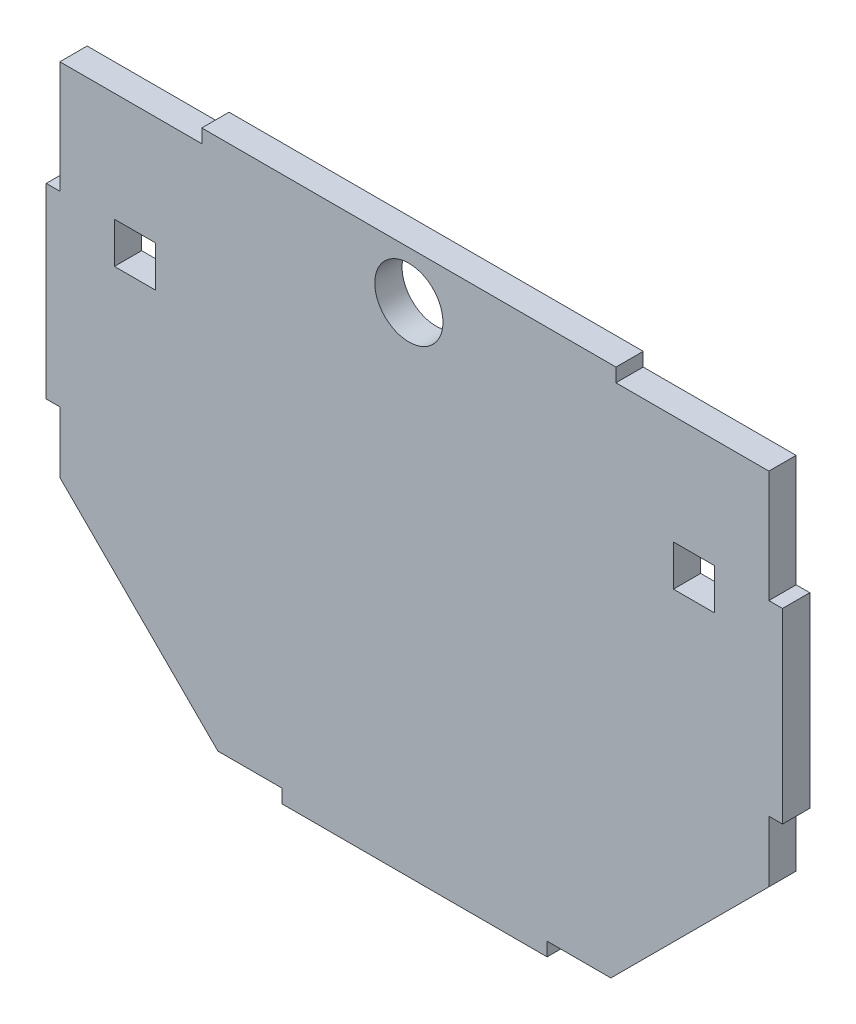
ISO-10303-21;
HEADER;
FILE_DESCRIPTION(('STEP AP214'),'2;1');
FILE_NAME('part.step','',(''),(''),'','','');
FILE_SCHEMA(('AUTOMOTIVE_DESIGN { 1 0 10303 214 1 1 1 1 }'));
ENDSEC;
DATA;
#1=APPLICATION_CONTEXT('core data for automotive mechanical design processes');
#2=APPLICATION_PROTOCOL_DEFINITION('international standard','automotive_design',2000,#1);
#3=PRODUCT_CONTEXT('',#1,'mechanical');
#4=PRODUCT('Part','Part','',(#3));
#5=PRODUCT_RELATED_PRODUCT_CATEGORY('part','',(#4));
#6=PRODUCT_DEFINITION_FORMATION('','',#4);
#7=PRODUCT_DEFINITION_CONTEXT('part definition',#1,'design');
#8=PRODUCT_DEFINITION('design','',#6,#7);
#9=PRODUCT_DEFINITION_SHAPE('','',#8);
#10=(LENGTH_UNIT() NAMED_UNIT(*) SI_UNIT(.MILLI.,.METRE.));
#11=(NAMED_UNIT(*) PLANE_ANGLE_UNIT() SI_UNIT($,.RADIAN.));
#12=(NAMED_UNIT(*) SI_UNIT($,.STERADIAN.) SOLID_ANGLE_UNIT());
#13=UNCERTAINTY_MEASURE_WITH_UNIT(LENGTH_MEASURE(1.E-05),#10,'distance_accuracy_value','');
#14=(GEOMETRIC_REPRESENTATION_CONTEXT(3) GLOBAL_UNCERTAINTY_ASSIGNED_CONTEXT((#13)) GLOBAL_UNIT_ASSIGNED_CONTEXT((#10,
#11,#12)) REPRESENTATION_CONTEXT('',''));
#15=CARTESIAN_POINT('',(0.,0.,0.));
#16=DIRECTION('',(0.,0.,1.));
#17=DIRECTION('',(1.,0.,0.));
#18=AXIS2_PLACEMENT_3D('',#15,#16,#17);
#19=CARTESIAN_POINT('',(498.299745886619,818.667305173515,12.7));
#20=DIRECTION('',(0.706896426643388,0.707317073170731,0.));
#21=DIRECTION('',(-0.707317073170731,0.706896426643388,0.));
#22=AXIS2_PLACEMENT_3D('',#19,#20,#21);
#23=PLANE('',#22);
#24=DIRECTION('',(0.707317073170731,-0.706896426643388,0.));
#25=VECTOR('',#24,1.);
#26=CARTESIAN_POINT('',(498.299745886619,818.667305173515,0.));
#27=LINE('',#26,#25);
#28=CARTESIAN_POINT('',(424.715446324431,892.207843625938,0.));
#29=VERTEX_POINT('',#28);
#30=CARTESIAN_POINT('',(498.299745886619,818.667305173515,0.));
#31=VERTEX_POINT('',#30);
#32=EDGE_CURVE('E268',#29,#31,#27,.T.);
#33=ORIENTED_EDGE('',*,*,#32,.T.);
#34=DIRECTION('',(0.,0.,-1.));
#35=VECTOR('',#34,1.);
#36=CARTESIAN_POINT('',(498.299745886619,818.667305173515,12.7));
#37=LINE('',#36,#35);
#38=CARTESIAN_POINT('',(498.299745886619,818.667305173515,12.7));
#39=VERTEX_POINT('',#38);
#40=EDGE_CURVE('E11',#39,#31,#37,.T.);
#41=ORIENTED_EDGE('',*,*,#40,.F.);
#42=DIRECTION('',(0.707317073170731,-0.706896426643388,0.));
#43=VECTOR('',#42,1.);
#44=CARTESIAN_POINT('',(498.299745886619,818.667305173515,12.7));
#45=LINE('',#44,#43);
#46=CARTESIAN_POINT('',(424.715446324431,892.207843625938,12.7));
#47=VERTEX_POINT('',#46);
#48=EDGE_CURVE('E307',#47,#39,#45,.T.);
#49=ORIENTED_EDGE('',*,*,#48,.F.);
#50=DIRECTION('',(0.,0.,-1.));
#51=VECTOR('',#50,1.);
#52=CARTESIAN_POINT('',(424.715446324431,892.207843625938,12.7));
#53=LINE('',#52,#51);
#54=EDGE_CURVE('E353',#47,#29,#53,.T.);
#55=ORIENTED_EDGE('',*,*,#54,.T.);
#56=EDGE_LOOP('',(#33,#41,#49,#55));
#57=FACE_BOUND('',#56,.T.);
#58=ADVANCED_FACE('F35',(#57),#23,.F.);
#59=CARTESIAN_POINT('',(528.064815274393,818.667305173515,12.7));
#60=DIRECTION('',(0.,1.,0.));
#61=DIRECTION('',(0.,0.,1.));
#62=AXIS2_PLACEMENT_3D('',#59,#60,#61);
#63=PLANE('',#62);
#64=DIRECTION('',(1.,0.,0.));
#65=VECTOR('',#64,1.);
#66=CARTESIAN_POINT('',(528.064815274393,818.667305173515,0.));
#67=LINE('',#66,#65);
#68=CARTESIAN_POINT('',(528.064815274393,818.667305173515,0.));
#69=VERTEX_POINT('',#68);
#70=EDGE_CURVE('E356',#31,#69,#67,.T.);
#71=ORIENTED_EDGE('',*,*,#70,.T.);
#72=DIRECTION('',(0.,0.,-1.));
#73=VECTOR('',#72,1.);
#74=CARTESIAN_POINT('',(528.064815274393,818.667305173515,12.7));
#75=LINE('',#74,#73);
#76=CARTESIAN_POINT('',(528.064815274393,818.667305173515,12.7));
#77=VERTEX_POINT('',#76);
#78=EDGE_CURVE('E42',#77,#69,#75,.T.);
#79=ORIENTED_EDGE('',*,*,#78,.F.);
#80=DIRECTION('',(1.,0.,0.));
#81=VECTOR('',#80,1.);
#82=CARTESIAN_POINT('',(528.064815274393,818.667305173515,12.7));
#83=LINE('',#82,#81);
#84=EDGE_CURVE('E310',#39,#77,#83,.T.);
#85=ORIENTED_EDGE('',*,*,#84,.F.);
#86=ORIENTED_EDGE('',*,*,#40,.T.);
#87=EDGE_LOOP('',(#71,#79,#85,#86));
#88=FACE_BOUND('',#87,.T.);
#89=ADVANCED_FACE('F482',(#88),#63,.F.);
#90=CARTESIAN_POINT('',(528.064815274393,812.317305173515,12.7));
#91=DIRECTION('',(1.,0.,0.));
#92=DIRECTION('',(0.,0.,-1.));
#93=AXIS2_PLACEMENT_3D('',#90,#91,#92);
#94=PLANE('',#93);
#95=DIRECTION('',(0.,-1.,0.));
#96=VECTOR('',#95,1.);
#97=CARTESIAN_POINT('',(528.064815274393,812.317305173515,0.));
#98=LINE('',#97,#96);
#99=CARTESIAN_POINT('',(528.064815274393,812.317305173515,0.));
#100=VERTEX_POINT('',#99);
#101=EDGE_CURVE('E358',#69,#100,#98,.T.);
#102=ORIENTED_EDGE('',*,*,#101,.T.);
#103=DIRECTION('',(0.,0.,-1.));
#104=VECTOR('',#103,1.);
#105=CARTESIAN_POINT('',(528.064815274393,812.317305173515,12.7));
#106=LINE('',#105,#104);
#107=CARTESIAN_POINT('',(528.064815274393,812.317305173515,12.7));
#108=VERTEX_POINT('',#107);
#109=EDGE_CURVE('E453',#108,#100,#106,.T.);
#110=ORIENTED_EDGE('',*,*,#109,.F.);
#111=DIRECTION('',(0.,-1.,0.));
#112=VECTOR('',#111,1.);
#113=CARTESIAN_POINT('',(528.064815274393,812.317305173515,12.7));
#114=LINE('',#113,#112);
#115=EDGE_CURVE('E313',#77,#108,#114,.T.);
#116=ORIENTED_EDGE('',*,*,#115,.F.);
#117=ORIENTED_EDGE('',*,*,#78,.T.);
#118=EDGE_LOOP('',(#102,#110,#116,#117));
#119=FACE_BOUND('',#118,.T.);
#120=ADVANCED_FACE('F460',(#119),#94,.F.);
#121=CARTESIAN_POINT('',(651.634447679094,812.317305173515,12.7));
#122=DIRECTION('',(0.,1.,0.));
#123=DIRECTION('',(0.,0.,1.));
#124=AXIS2_PLACEMENT_3D('',#121,#122,#123);
#125=PLANE('',#124);
#126=DIRECTION('',(1.,0.,0.));
#127=VECTOR('',#126,1.);
#128=CARTESIAN_POINT('',(651.634447679094,812.317305173515,0.));
#129=LINE('',#128,#127);
#130=CARTESIAN_POINT('',(651.634447679094,812.317305173515,0.));
#131=VERTEX_POINT('',#130);
#132=EDGE_CURVE('E360',#100,#131,#129,.T.);
#133=ORIENTED_EDGE('',*,*,#132,.T.);
#134=DIRECTION('',(0.,0.,-1.));
#135=VECTOR('',#134,1.);
#136=CARTESIAN_POINT('',(651.634447679094,812.317305173515,12.7));
#137=LINE('',#136,#135);
#138=CARTESIAN_POINT('',(651.634447679094,812.317305173515,12.7));
#139=VERTEX_POINT('',#138);
#140=EDGE_CURVE('E450',#139,#131,#137,.T.);
#141=ORIENTED_EDGE('',*,*,#140,.F.);
#142=DIRECTION('',(1.,0.,0.));
#143=VECTOR('',#142,1.);
#144=CARTESIAN_POINT('',(651.634447679094,812.317305173515,12.7));
#145=LINE('',#144,#143);
#146=EDGE_CURVE('E315',#108,#139,#145,.T.);
#147=ORIENTED_EDGE('',*,*,#146,.F.);
#148=ORIENTED_EDGE('',*,*,#109,.T.);
#149=EDGE_LOOP('',(#133,#141,#147,#148));
#150=FACE_BOUND('',#149,.T.);
#151=ADVANCED_FACE('F470',(#150),#125,.F.);
#152=CARTESIAN_POINT('',(651.634447679094,818.667305173515,12.7));
#153=DIRECTION('',(-1.,0.,0.));
#154=DIRECTION('',(0.,0.,1.));
#155=AXIS2_PLACEMENT_3D('',#152,#153,#154);
#156=PLANE('',#155);
#157=DIRECTION('',(0.,1.,0.));
#158=VECTOR('',#157,1.);
#159=CARTESIAN_POINT('',(651.634447679094,818.667305173515,0.));
#160=LINE('',#159,#158);
#161=CARTESIAN_POINT('',(651.634447679094,818.667305173515,0.));
#162=VERTEX_POINT('',#161);
#163=EDGE_CURVE('E362',#131,#162,#160,.T.);
#164=ORIENTED_EDGE('',*,*,#163,.T.);
#165=DIRECTION('',(0.,0.,-1.));
#166=VECTOR('',#165,1.);
#167=CARTESIAN_POINT('',(651.634447679094,818.667305173515,12.7));
#168=LINE('',#167,#166);
#169=CARTESIAN_POINT('',(651.634447679094,818.667305173515,12.7));
#170=VERTEX_POINT('',#169);
#171=EDGE_CURVE('E447',#170,#162,#168,.T.);
#172=ORIENTED_EDGE('',*,*,#171,.F.);
#173=DIRECTION('',(0.,1.,0.));
#174=VECTOR('',#173,1.);
#175=CARTESIAN_POINT('',(651.634447679094,818.667305173515,12.7));
#176=LINE('',#175,#174);
#177=EDGE_CURVE('E317',#139,#170,#176,.T.);
#178=ORIENTED_EDGE('',*,*,#177,.F.);
#179=ORIENTED_EDGE('',*,*,#140,.T.);
#180=EDGE_LOOP('',(#164,#172,#178,#179));
#181=FACE_BOUND('',#180,.T.);
#182=ADVANCED_FACE('F474',(#181),#156,.F.);
#183=CARTESIAN_POINT('',(681.331146762242,818.667305173515,12.7));
#184=DIRECTION('',(0.,1.,0.));
#185=DIRECTION('',(0.,0.,1.));
#186=AXIS2_PLACEMENT_3D('',#183,#184,#185);
#187=PLANE('',#186);
#188=DIRECTION('',(1.,0.,0.));
#189=VECTOR('',#188,1.);
#190=CARTESIAN_POINT('',(681.331146762242,818.667305173515,0.));
#191=LINE('',#190,#189);
#192=CARTESIAN_POINT('',(681.331146762242,818.667305173515,0.));
#193=VERTEX_POINT('',#192);
#194=EDGE_CURVE('E364',#162,#193,#191,.T.);
#195=ORIENTED_EDGE('',*,*,#194,.T.);
#196=DIRECTION('',(0.,0.,-1.));
#197=VECTOR('',#196,1.);
#198=CARTESIAN_POINT('',(681.331146762242,818.667305173515,12.7));
#199=LINE('',#198,#197);
#200=CARTESIAN_POINT('',(681.331146762242,818.667305173515,12.7));
#201=VERTEX_POINT('',#200);
#202=EDGE_CURVE('E444',#201,#193,#199,.T.);
#203=ORIENTED_EDGE('',*,*,#202,.F.);
#204=DIRECTION('',(1.,0.,0.));
#205=VECTOR('',#204,1.);
#206=CARTESIAN_POINT('',(681.331146762242,818.667305173515,12.7));
#207=LINE('',#206,#205);
#208=EDGE_CURVE('E319',#170,#201,#207,.T.);
#209=ORIENTED_EDGE('',*,*,#208,.F.);
#210=ORIENTED_EDGE('',*,*,#171,.T.);
#211=EDGE_LOOP('',(#195,#203,#209,#210));
#212=FACE_BOUND('',#211,.T.);
#213=ADVANCED_FACE('F565',(#212),#187,.F.);
#214=CARTESIAN_POINT('',(754.915446324431,892.207843625938,12.7));
#215=DIRECTION('',(-0.706896426643387,0.707317073170732,0.));
#216=DIRECTION('',(-0.707317073170732,-0.706896426643387,0.));
#217=AXIS2_PLACEMENT_3D('',#214,#215,#216);
#218=PLANE('',#217);
#219=DIRECTION('',(0.707317073170732,0.706896426643387,0.));
#220=VECTOR('',#219,1.);
#221=CARTESIAN_POINT('',(754.915446324431,892.207843625938,0.));
#222=LINE('',#221,#220);
#223=CARTESIAN_POINT('',(754.915446324431,892.207843625938,0.));
#224=VERTEX_POINT('',#223);
#225=EDGE_CURVE('E366',#193,#224,#222,.T.);
#226=ORIENTED_EDGE('',*,*,#225,.T.);
#227=DIRECTION('',(0.,0.,-1.));
#228=VECTOR('',#227,1.);
#229=CARTESIAN_POINT('',(754.915446324431,892.207843625938,12.7));
#230=LINE('',#229,#228);
#231=CARTESIAN_POINT('',(754.915446324431,892.207843625938,12.7));
#232=VERTEX_POINT('',#231);
#233=EDGE_CURVE('E441',#232,#224,#230,.T.);
#234=ORIENTED_EDGE('',*,*,#233,.F.);
#235=DIRECTION('',(0.707317073170732,0.706896426643387,0.));
#236=VECTOR('',#235,1.);
#237=CARTESIAN_POINT('',(754.915446324431,892.207843625938,12.7));
#238=LINE('',#237,#236);
#239=EDGE_CURVE('E321',#201,#232,#238,.T.);
#240=ORIENTED_EDGE('',*,*,#239,.F.);
#241=ORIENTED_EDGE('',*,*,#202,.T.);
#242=EDGE_LOOP('',(#226,#234,#240,#241));
#243=FACE_BOUND('',#242,.T.);
#244=ADVANCED_FACE('F562',(#243),#218,.F.);
#245=CARTESIAN_POINT('',(754.915446324431,920.715652438915,12.7));
#246=DIRECTION('',(-1.,0.,0.));
#247=DIRECTION('',(0.,0.,1.));
#248=AXIS2_PLACEMENT_3D('',#245,#246,#247);
#249=PLANE('',#248);
#250=DIRECTION('',(0.,1.,0.));
#251=VECTOR('',#250,1.);
#252=CARTESIAN_POINT('',(754.915446324431,920.715652438915,0.));
#253=LINE('',#252,#251);
#254=CARTESIAN_POINT('',(754.915446324431,920.715652438915,0.));
#255=VERTEX_POINT('',#254);
#256=EDGE_CURVE('E368',#224,#255,#253,.T.);
#257=ORIENTED_EDGE('',*,*,#256,.T.);
#258=DIRECTION('',(0.,0.,-1.));
#259=VECTOR('',#258,1.);
#260=CARTESIAN_POINT('',(754.915446324431,920.715652438915,12.7));
#261=LINE('',#260,#259);
#262=CARTESIAN_POINT('',(754.915446324431,920.715652438915,12.7));
#263=VERTEX_POINT('',#262);
#264=EDGE_CURVE('E438',#263,#255,#261,.T.);
#265=ORIENTED_EDGE('',*,*,#264,.F.);
#266=DIRECTION('',(0.,1.,0.));
#267=VECTOR('',#266,1.);
#268=CARTESIAN_POINT('',(754.915446324431,920.715652438915,12.7));
#269=LINE('',#268,#267);
#270=EDGE_CURVE('E323',#232,#263,#269,.T.);
#271=ORIENTED_EDGE('',*,*,#270,.F.);
#272=ORIENTED_EDGE('',*,*,#233,.T.);
#273=EDGE_LOOP('',(#257,#265,#271,#272));
#274=FACE_BOUND('',#273,.T.);
#275=ADVANCED_FACE('F558',(#274),#249,.F.);
#276=CARTESIAN_POINT('',(761.265446324431,920.715652438915,12.7));
#277=DIRECTION('',(0.,1.,0.));
#278=DIRECTION('',(0.,0.,1.));
#279=AXIS2_PLACEMENT_3D('',#276,#277,#278);
#280=PLANE('',#279);
#281=DIRECTION('',(1.,0.,0.));
#282=VECTOR('',#281,1.);
#283=CARTESIAN_POINT('',(761.265446324431,920.715652438915,0.));
#284=LINE('',#283,#282);
#285=CARTESIAN_POINT('',(761.265446324431,920.715652438915,0.));
#286=VERTEX_POINT('',#285);
#287=EDGE_CURVE('E370',#255,#286,#284,.T.);
#288=ORIENTED_EDGE('',*,*,#287,.T.);
#289=DIRECTION('',(0.,0.,-1.));
#290=VECTOR('',#289,1.);
#291=CARTESIAN_POINT('',(761.265446324431,920.715652438915,12.7));
#292=LINE('',#291,#290);
#293=CARTESIAN_POINT('',(761.265446324431,920.715652438915,12.7));
#294=VERTEX_POINT('',#293);
#295=EDGE_CURVE('E435',#294,#286,#292,.T.);
#296=ORIENTED_EDGE('',*,*,#295,.F.);
#297=DIRECTION('',(1.,0.,0.));
#298=VECTOR('',#297,1.);
#299=CARTESIAN_POINT('',(761.265446324431,920.715652438915,12.7));
#300=LINE('',#299,#298);
#301=EDGE_CURVE('E325',#263,#294,#300,.T.);
#302=ORIENTED_EDGE('',*,*,#301,.F.);
#303=ORIENTED_EDGE('',*,*,#264,.T.);
#304=EDGE_LOOP('',(#288,#296,#302,#303));
#305=FACE_BOUND('',#304,.T.);
#306=ADVANCED_FACE('F554',(#305),#280,.F.);
#307=CARTESIAN_POINT('',(761.265446324431,1007.69185338905,12.7));
#308=DIRECTION('',(-1.,0.,0.));
#309=DIRECTION('',(0.,0.,1.));
#310=AXIS2_PLACEMENT_3D('',#307,#308,#309);
#311=PLANE('',#310);
#312=DIRECTION('',(0.,1.,0.));
#313=VECTOR('',#312,1.);
#314=CARTESIAN_POINT('',(761.265446324431,1007.69185338905,0.));
#315=LINE('',#314,#313);
#316=CARTESIAN_POINT('',(761.265446324431,1007.69185338905,0.));
#317=VERTEX_POINT('',#316);
#318=EDGE_CURVE('E372',#286,#317,#315,.T.);
#319=ORIENTED_EDGE('',*,*,#318,.T.);
#320=DIRECTION('',(0.,0.,-1.));
#321=VECTOR('',#320,1.);
#322=CARTESIAN_POINT('',(761.265446324431,1007.69185338905,12.7));
#323=LINE('',#322,#321);
#324=CARTESIAN_POINT('',(761.265446324431,1007.69185338905,12.7));
#325=VERTEX_POINT('',#324);
#326=EDGE_CURVE('E432',#325,#317,#323,.T.);
#327=ORIENTED_EDGE('',*,*,#326,.F.);
#328=DIRECTION('',(0.,1.,0.));
#329=VECTOR('',#328,1.);
#330=CARTESIAN_POINT('',(761.265446324431,1007.69185338905,12.7));
#331=LINE('',#330,#329);
#332=EDGE_CURVE('E327',#294,#325,#331,.T.);
#333=ORIENTED_EDGE('',*,*,#332,.F.);
#334=ORIENTED_EDGE('',*,*,#295,.T.);
#335=EDGE_LOOP('',(#319,#327,#333,#334));
#336=FACE_BOUND('',#335,.T.);
#337=ADVANCED_FACE('F549',(#336),#311,.F.);
#338=CARTESIAN_POINT('',(754.915446324431,1007.69185338905,12.7));
#339=DIRECTION('',(0.,-1.,0.));
#340=DIRECTION('',(0.,0.,-1.));
#341=AXIS2_PLACEMENT_3D('',#338,#339,#340);
#342=PLANE('',#341);
#343=DIRECTION('',(-1.,0.,0.));
#344=VECTOR('',#343,1.);
#345=CARTESIAN_POINT('',(754.915446324431,1007.69185338905,0.));
#346=LINE('',#345,#344);
#347=CARTESIAN_POINT('',(754.915446324431,1007.69185338905,0.));
#348=VERTEX_POINT('',#347);
#349=EDGE_CURVE('E374',#317,#348,#346,.T.);
#350=ORIENTED_EDGE('',*,*,#349,.T.);
#351=DIRECTION('',(0.,0.,-1.));
#352=VECTOR('',#351,1.);
#353=CARTESIAN_POINT('',(754.915446324431,1007.69185338905,12.7));
#354=LINE('',#353,#352);
#355=CARTESIAN_POINT('',(754.915446324431,1007.69185338905,12.7));
#356=VERTEX_POINT('',#355);
#357=EDGE_CURVE('E429',#356,#348,#354,.T.);
#358=ORIENTED_EDGE('',*,*,#357,.F.);
#359=DIRECTION('',(-1.,0.,0.));
#360=VECTOR('',#359,1.);
#361=CARTESIAN_POINT('',(754.915446324431,1007.69185338905,12.7));
#362=LINE('',#361,#360);
#363=EDGE_CURVE('E329',#325,#356,#362,.T.);
#364=ORIENTED_EDGE('',*,*,#363,.F.);
#365=ORIENTED_EDGE('',*,*,#326,.T.);
#366=EDGE_LOOP('',(#350,#358,#364,#365));
#367=FACE_BOUND('',#366,.T.);
#368=ADVANCED_FACE('F543',(#367),#342,.F.);
#369=CARTESIAN_POINT('',(754.915446324431,1059.91911843122,12.7));
#370=DIRECTION('',(-1.,0.,0.));
#371=DIRECTION('',(0.,0.,1.));
#372=AXIS2_PLACEMENT_3D('',#369,#370,#371);
#373=PLANE('',#372);
#374=DIRECTION('',(0.,1.,0.));
#375=VECTOR('',#374,1.);
#376=CARTESIAN_POINT('',(754.915446324431,1059.91911843122,0.));
#377=LINE('',#376,#375);
#378=CARTESIAN_POINT('',(754.915446324431,1059.91911843122,0.));
#379=VERTEX_POINT('',#378);
#380=EDGE_CURVE('E376',#348,#379,#377,.T.);
#381=ORIENTED_EDGE('',*,*,#380,.T.);
#382=DIRECTION('',(0.,0.,-1.));
#383=VECTOR('',#382,1.);
#384=CARTESIAN_POINT('',(754.915446324431,1059.91911843122,12.7));
#385=LINE('',#384,#383);
#386=CARTESIAN_POINT('',(754.915446324431,1059.91911843122,12.7));
#387=VERTEX_POINT('',#386);
#388=EDGE_CURVE('E426',#387,#379,#385,.T.);
#389=ORIENTED_EDGE('',*,*,#388,.F.);
#390=DIRECTION('',(0.,1.,0.));
#391=VECTOR('',#390,1.);
#392=CARTESIAN_POINT('',(754.915446324431,1059.91911843122,12.7));
#393=LINE('',#392,#391);
#394=EDGE_CURVE('E331',#356,#387,#393,.T.);
#395=ORIENTED_EDGE('',*,*,#394,.F.);
#396=ORIENTED_EDGE('',*,*,#357,.T.);
#397=EDGE_LOOP('',(#381,#389,#395,#396));
#398=FACE_BOUND('',#397,.T.);
#399=ADVANCED_FACE('F539',(#398),#373,.F.);
#400=CARTESIAN_POINT('',(683.700037549844,1059.91911843122,12.7));
#401=DIRECTION('',(0.,-1.,0.));
#402=DIRECTION('',(0.,0.,-1.));
#403=AXIS2_PLACEMENT_3D('',#400,#401,#402);
#404=PLANE('',#403);
#405=DIRECTION('',(-1.,0.,0.));
#406=VECTOR('',#405,1.);
#407=CARTESIAN_POINT('',(683.700037549844,1059.91911843122,0.));
#408=LINE('',#407,#406);
#409=CARTESIAN_POINT('',(683.700037549844,1059.91911843122,0.));
#410=VERTEX_POINT('',#409);
#411=EDGE_CURVE('E378',#379,#410,#408,.T.);
#412=ORIENTED_EDGE('',*,*,#411,.T.);
#413=DIRECTION('',(0.,0.,-1.));
#414=VECTOR('',#413,1.);
#415=CARTESIAN_POINT('',(683.700037549844,1059.91911843122,12.7));
#416=LINE('',#415,#414);
#417=CARTESIAN_POINT('',(683.700037549844,1059.91911843122,12.7));
#418=VERTEX_POINT('',#417);
#419=EDGE_CURVE('E423',#418,#410,#416,.T.);
#420=ORIENTED_EDGE('',*,*,#419,.F.);
#421=DIRECTION('',(-1.,0.,0.));
#422=VECTOR('',#421,1.);
#423=CARTESIAN_POINT('',(683.700037549844,1059.91911843122,12.7));
#424=LINE('',#423,#422);
#425=EDGE_CURVE('E333',#387,#418,#424,.T.);
#426=ORIENTED_EDGE('',*,*,#425,.F.);
#427=ORIENTED_EDGE('',*,*,#388,.T.);
#428=EDGE_LOOP('',(#412,#420,#426,#427));
#429=FACE_BOUND('',#428,.T.);
#430=ADVANCED_FACE('F534',(#429),#404,.F.);
#431=CARTESIAN_POINT('',(683.700037549844,1059.91911843122,12.7));
#432=DIRECTION('',(-1.,0.,0.));
#433=DIRECTION('',(0.,0.,1.));
#434=AXIS2_PLACEMENT_3D('',#431,#432,#433);
#435=PLANE('',#434);
#436=DIRECTION('',(0.,1.,0.));
#437=VECTOR('',#436,1.);
#438=CARTESIAN_POINT('',(683.700037549844,1059.91911843122,0.));
#439=LINE('',#438,#437);
#440=CARTESIAN_POINT('',(683.700037549844,1066.26911843122,0.));
#441=VERTEX_POINT('',#440);
#442=EDGE_CURVE('E380',#410,#441,#439,.T.);
#443=ORIENTED_EDGE('',*,*,#442,.T.);
#444=DIRECTION('',(0.,0.,-1.));
#445=VECTOR('',#444,1.);
#446=CARTESIAN_POINT('',(683.700037549844,1066.26911843122,12.7));
#447=LINE('',#446,#445);
#448=CARTESIAN_POINT('',(683.700037549844,1066.26911843122,12.7));
#449=VERTEX_POINT('',#448);
#450=EDGE_CURVE('E420',#449,#441,#447,.T.);
#451=ORIENTED_EDGE('',*,*,#450,.F.);
#452=DIRECTION('',(0.,1.,0.));
#453=VECTOR('',#452,1.);
#454=CARTESIAN_POINT('',(683.700037549844,1059.91911843122,12.7));
#455=LINE('',#454,#453);
#456=EDGE_CURVE('E335',#418,#449,#455,.T.);
#457=ORIENTED_EDGE('',*,*,#456,.F.);
#458=ORIENTED_EDGE('',*,*,#419,.T.);
#459=EDGE_LOOP('',(#443,#451,#457,#458));
#460=FACE_BOUND('',#459,.T.);
#461=ADVANCED_FACE('F528',(#460),#435,.F.);
#462=CARTESIAN_POINT('',(683.700037549844,1066.26911843122,12.7));
#463=DIRECTION('',(0.,-1.,0.));
#464=DIRECTION('',(0.,0.,-1.));
#465=AXIS2_PLACEMENT_3D('',#462,#463,#464);
#466=PLANE('',#465);
#467=DIRECTION('',(-1.,0.,0.));
#468=VECTOR('',#467,1.);
#469=CARTESIAN_POINT('',(683.700037549844,1066.26911843122,0.));
#470=LINE('',#469,#468);
#471=CARTESIAN_POINT('',(490.806723978515,1066.26911843122,0.));
#472=VERTEX_POINT('',#471);
#473=EDGE_CURVE('E382',#441,#472,#470,.T.);
#474=ORIENTED_EDGE('',*,*,#473,.T.);
#475=DIRECTION('',(0.,0.,-1.));
#476=VECTOR('',#475,1.);
#477=CARTESIAN_POINT('',(490.806723978515,1066.26911843122,12.7));
#478=LINE('',#477,#476);
#479=CARTESIAN_POINT('',(490.806723978515,1066.26911843122,12.7));
#480=VERTEX_POINT('',#479);
#481=EDGE_CURVE('E417',#480,#472,#478,.T.);
#482=ORIENTED_EDGE('',*,*,#481,.F.);
#483=DIRECTION('',(-1.,0.,0.));
#484=VECTOR('',#483,1.);
#485=CARTESIAN_POINT('',(683.700037549844,1066.26911843122,12.7));
#486=LINE('',#485,#484);
#487=EDGE_CURVE('E337',#449,#480,#486,.T.);
#488=ORIENTED_EDGE('',*,*,#487,.F.);
#489=ORIENTED_EDGE('',*,*,#450,.T.);
#490=EDGE_LOOP('',(#474,#482,#488,#489));
#491=FACE_BOUND('',#490,.T.);
#492=ADVANCED_FACE('F524',(#491),#466,.F.);
#493=CARTESIAN_POINT('',(490.806723978515,1059.91911843122,12.7));
#494=DIRECTION('',(1.,0.,0.));
#495=DIRECTION('',(0.,1.,0.));
#496=AXIS2_PLACEMENT_3D('',#493,#494,#495);
#497=PLANE('',#496);
#498=DIRECTION('',(0.,-1.,0.));
#499=VECTOR('',#498,1.);
#500=CARTESIAN_POINT('',(490.806723978515,1059.91911843122,0.));
#501=LINE('',#500,#499);
#502=CARTESIAN_POINT('',(490.806723978515,1059.91911843122,0.));
#503=VERTEX_POINT('',#502);
#504=EDGE_CURVE('E384',#472,#503,#501,.T.);
#505=ORIENTED_EDGE('',*,*,#504,.T.);
#506=DIRECTION('',(0.,0.,-1.));
#507=VECTOR('',#506,1.);
#508=CARTESIAN_POINT('',(490.806723978515,1059.91911843122,12.7));
#509=LINE('',#508,#507);
#510=CARTESIAN_POINT('',(490.806723978515,1059.91911843122,12.7));
#511=VERTEX_POINT('',#510);
#512=EDGE_CURVE('E414',#511,#503,#509,.T.);
#513=ORIENTED_EDGE('',*,*,#512,.F.);
#514=DIRECTION('',(0.,-1.,0.));
#515=VECTOR('',#514,1.);
#516=CARTESIAN_POINT('',(490.806723978515,1059.91911843122,12.7));
#517=LINE('',#516,#515);
#518=EDGE_CURVE('E339',#480,#511,#517,.T.);
#519=ORIENTED_EDGE('',*,*,#518,.F.);
#520=ORIENTED_EDGE('',*,*,#481,.T.);
#521=EDGE_LOOP('',(#505,#513,#519,#520));
#522=FACE_BOUND('',#521,.T.);
#523=ADVANCED_FACE('F519',(#522),#497,.F.);
#524=CARTESIAN_POINT('',(424.715446324431,1059.91911843122,12.7));
#525=DIRECTION('',(0.,-1.,0.));
#526=DIRECTION('',(0.,0.,-1.));
#527=AXIS2_PLACEMENT_3D('',#524,#525,#526);
#528=PLANE('',#527);
#529=DIRECTION('',(-1.,0.,0.));
#530=VECTOR('',#529,1.);
#531=CARTESIAN_POINT('',(424.715446324431,1059.91911843122,0.));
#532=LINE('',#531,#530);
#533=CARTESIAN_POINT('',(424.715446324431,1059.91911843122,0.));
#534=VERTEX_POINT('',#533);
#535=EDGE_CURVE('E386',#503,#534,#532,.T.);
#536=ORIENTED_EDGE('',*,*,#535,.T.);
#537=DIRECTION('',(0.,0.,-1.));
#538=VECTOR('',#537,1.);
#539=CARTESIAN_POINT('',(424.715446324431,1059.91911843122,12.7));
#540=LINE('',#539,#538);
#541=CARTESIAN_POINT('',(424.715446324431,1059.91911843122,12.7));
#542=VERTEX_POINT('',#541);
#543=EDGE_CURVE('E411',#542,#534,#540,.T.);
#544=ORIENTED_EDGE('',*,*,#543,.F.);
#545=DIRECTION('',(-1.,0.,0.));
#546=VECTOR('',#545,1.);
#547=CARTESIAN_POINT('',(424.715446324431,1059.91911843122,12.7));
#548=LINE('',#547,#546);
#549=EDGE_CURVE('E341',#511,#542,#548,.T.);
#550=ORIENTED_EDGE('',*,*,#549,.F.);
#551=ORIENTED_EDGE('',*,*,#512,.T.);
#552=EDGE_LOOP('',(#536,#544,#550,#551));
#553=FACE_BOUND('',#552,.T.);
#554=ADVANCED_FACE('F513',(#553),#528,.F.);
#555=CARTESIAN_POINT('',(424.715446324431,1007.69185338905,12.7));
#556=DIRECTION('',(1.,0.,0.));
#557=DIRECTION('',(0.,0.,-1.));
#558=AXIS2_PLACEMENT_3D('',#555,#556,#557);
#559=PLANE('',#558);
#560=DIRECTION('',(0.,-1.,0.));
#561=VECTOR('',#560,1.);
#562=CARTESIAN_POINT('',(424.715446324431,1007.69185338905,0.));
#563=LINE('',#562,#561);
#564=CARTESIAN_POINT('',(424.715446324431,1007.69185338905,0.));
#565=VERTEX_POINT('',#564);
#566=EDGE_CURVE('E388',#534,#565,#563,.T.);
#567=ORIENTED_EDGE('',*,*,#566,.T.);
#568=DIRECTION('',(0.,0.,-1.));
#569=VECTOR('',#568,1.);
#570=CARTESIAN_POINT('',(424.715446324431,1007.69185338905,12.7));
#571=LINE('',#570,#569);
#572=CARTESIAN_POINT('',(424.715446324431,1007.69185338905,12.7));
#573=VERTEX_POINT('',#572);
#574=EDGE_CURVE('E408',#573,#565,#571,.T.);
#575=ORIENTED_EDGE('',*,*,#574,.F.);
#576=DIRECTION('',(0.,-1.,0.));
#577=VECTOR('',#576,1.);
#578=CARTESIAN_POINT('',(424.715446324431,1007.69185338905,12.7));
#579=LINE('',#578,#577);
#580=EDGE_CURVE('E343',#542,#573,#579,.T.);
#581=ORIENTED_EDGE('',*,*,#580,.F.);
#582=ORIENTED_EDGE('',*,*,#543,.T.);
#583=EDGE_LOOP('',(#567,#575,#581,#582));
#584=FACE_BOUND('',#583,.T.);
#585=ADVANCED_FACE('F509',(#584),#559,.F.);
#586=CARTESIAN_POINT('',(418.365446324431,1007.69185338905,12.7));
#587=DIRECTION('',(0.,-1.,0.));
#588=DIRECTION('',(0.,0.,-1.));
#589=AXIS2_PLACEMENT_3D('',#586,#587,#588);
#590=PLANE('',#589);
#591=DIRECTION('',(-1.,0.,0.));
#592=VECTOR('',#591,1.);
#593=CARTESIAN_POINT('',(418.365446324431,1007.69185338905,0.));
#594=LINE('',#593,#592);
#595=CARTESIAN_POINT('',(418.365446324431,1007.69185338905,0.));
#596=VERTEX_POINT('',#595);
#597=EDGE_CURVE('E390',#565,#596,#594,.T.);
#598=ORIENTED_EDGE('',*,*,#597,.T.);
#599=DIRECTION('',(0.,0.,-1.));
#600=VECTOR('',#599,1.);
#601=CARTESIAN_POINT('',(418.365446324431,1007.69185338905,12.7));
#602=LINE('',#601,#600);
#603=CARTESIAN_POINT('',(418.365446324431,1007.69185338905,12.7));
#604=VERTEX_POINT('',#603);
#605=EDGE_CURVE('E405',#604,#596,#602,.T.);
#606=ORIENTED_EDGE('',*,*,#605,.F.);
#607=DIRECTION('',(-1.,0.,0.));
#608=VECTOR('',#607,1.);
#609=CARTESIAN_POINT('',(418.365446324431,1007.69185338905,12.7));
#610=LINE('',#609,#608);
#611=EDGE_CURVE('E345',#573,#604,#610,.T.);
#612=ORIENTED_EDGE('',*,*,#611,.F.);
#613=ORIENTED_EDGE('',*,*,#574,.T.);
#614=EDGE_LOOP('',(#598,#606,#612,#613));
#615=FACE_BOUND('',#614,.T.);
#616=ADVANCED_FACE('F504',(#615),#590,.F.);
#617=CARTESIAN_POINT('',(418.365446324431,920.715652438915,12.7));
#618=DIRECTION('',(1.,0.,0.));
#619=DIRECTION('',(0.,0.,-1.));
#620=AXIS2_PLACEMENT_3D('',#617,#618,#619);
#621=PLANE('',#620);
#622=DIRECTION('',(0.,-1.,0.));
#623=VECTOR('',#622,1.);
#624=CARTESIAN_POINT('',(418.365446324431,920.715652438915,0.));
#625=LINE('',#624,#623);
#626=CARTESIAN_POINT('',(418.365446324431,920.715652438915,0.));
#627=VERTEX_POINT('',#626);
#628=EDGE_CURVE('E392',#596,#627,#625,.T.);
#629=ORIENTED_EDGE('',*,*,#628,.T.);
#630=DIRECTION('',(0.,0.,-1.));
#631=VECTOR('',#630,1.);
#632=CARTESIAN_POINT('',(418.365446324431,920.715652438915,12.7));
#633=LINE('',#632,#631);
#634=CARTESIAN_POINT('',(418.365446324431,920.715652438915,12.7));
#635=VERTEX_POINT('',#634);
#636=EDGE_CURVE('E402',#635,#627,#633,.T.);
#637=ORIENTED_EDGE('',*,*,#636,.F.);
#638=DIRECTION('',(0.,-1.,0.));
#639=VECTOR('',#638,1.);
#640=CARTESIAN_POINT('',(418.365446324431,920.715652438915,12.7));
#641=LINE('',#640,#639);
#642=EDGE_CURVE('E347',#604,#635,#641,.T.);
#643=ORIENTED_EDGE('',*,*,#642,.F.);
#644=ORIENTED_EDGE('',*,*,#605,.T.);
#645=EDGE_LOOP('',(#629,#637,#643,#644));
#646=FACE_BOUND('',#645,.T.);
#647=ADVANCED_FACE('F498',(#646),#621,.F.);
#648=CARTESIAN_POINT('',(424.715446324431,920.715652438915,12.7));
#649=DIRECTION('',(0.,1.,0.));
#650=DIRECTION('',(0.,0.,1.));
#651=AXIS2_PLACEMENT_3D('',#648,#649,#650);
#652=PLANE('',#651);
#653=DIRECTION('',(1.,0.,0.));
#654=VECTOR('',#653,1.);
#655=CARTESIAN_POINT('',(424.715446324431,920.715652438915,0.));
#656=LINE('',#655,#654);
#657=CARTESIAN_POINT('',(424.715446324431,920.715652438915,0.));
#658=VERTEX_POINT('',#657);
#659=EDGE_CURVE('E394',#627,#658,#656,.T.);
#660=ORIENTED_EDGE('',*,*,#659,.T.);
#661=DIRECTION('',(0.,0.,-1.));
#662=VECTOR('',#661,1.);
#663=CARTESIAN_POINT('',(424.715446324431,920.715652438915,12.7));
#664=LINE('',#663,#662);
#665=CARTESIAN_POINT('',(424.715446324431,920.715652438915,12.7));
#666=VERTEX_POINT('',#665);
#667=EDGE_CURVE('E399',#666,#658,#664,.T.);
#668=ORIENTED_EDGE('',*,*,#667,.F.);
#669=DIRECTION('',(1.,0.,0.));
#670=VECTOR('',#669,1.);
#671=CARTESIAN_POINT('',(424.715446324431,920.715652438915,12.7));
#672=LINE('',#671,#670);
#673=EDGE_CURVE('E349',#635,#666,#672,.T.);
#674=ORIENTED_EDGE('',*,*,#673,.F.);
#675=ORIENTED_EDGE('',*,*,#636,.T.);
#676=EDGE_LOOP('',(#660,#668,#674,#675));
#677=FACE_BOUND('',#676,.T.);
#678=ADVANCED_FACE('F494',(#677),#652,.F.);
#679=CARTESIAN_POINT('',(424.715446324431,892.207843625938,12.7));
#680=DIRECTION('',(1.,0.,0.));
#681=DIRECTION('',(0.,0.,-1.));
#682=AXIS2_PLACEMENT_3D('',#679,#680,#681);
#683=PLANE('',#682);
#684=DIRECTION('',(0.,-1.,0.));
#685=VECTOR('',#684,1.);
#686=CARTESIAN_POINT('',(424.715446324431,892.207843625938,0.));
#687=LINE('',#686,#685);
#688=EDGE_CURVE('E311',#658,#29,#687,.T.);
#689=ORIENTED_EDGE('',*,*,#688,.T.);
#690=ORIENTED_EDGE('',*,*,#54,.F.);
#691=DIRECTION('',(0.,-1.,0.));
#692=VECTOR('',#691,1.);
#693=CARTESIAN_POINT('',(424.715446324431,892.207843625938,12.7));
#694=LINE('',#693,#692);
#695=EDGE_CURVE('E351',#666,#47,#694,.T.);
#696=ORIENTED_EDGE('',*,*,#695,.F.);
#697=ORIENTED_EDGE('',*,*,#667,.T.);
#698=EDGE_LOOP('',(#689,#690,#696,#697));
#699=FACE_BOUND('',#698,.T.);
#700=ADVANCED_FACE('F489',(#699),#683,.F.);
#701=CARTESIAN_POINT('',(0.,0.,12.7));
#702=DIRECTION('',(0.,0.,1.));
#703=DIRECTION('',(1.,0.,0.));
#704=AXIS2_PLACEMENT_3D('',#701,#702,#703);
#705=PLANE('',#704);
#706=DIRECTION('',(0.,-1.,0.));
#707=VECTOR('',#706,1.);
#708=CARTESIAN_POINT('',(450.115446324431,1009.11911843122,12.7));
#709=LINE('',#708,#707);
#710=CARTESIAN_POINT('',(450.115446324431,1009.11911843122,12.7));
#711=VERTEX_POINT('',#710);
#712=CARTESIAN_POINT('',(450.115446324431,990.069118431221,12.7));
#713=VERTEX_POINT('',#712);
#714=EDGE_CURVE('E49',#711,#713,#709,.T.);
#715=ORIENTED_EDGE('',*,*,#714,.F.);
#716=DIRECTION('',(-1.,0.,0.));
#717=VECTOR('',#716,1.);
#718=CARTESIAN_POINT('',(450.115446324431,1009.11911843122,12.7));
#719=LINE('',#718,#717);
#720=CARTESIAN_POINT('',(469.165446324431,1009.11911843122,12.7));
#721=VERTEX_POINT('',#720);
#722=EDGE_CURVE('E252',#721,#711,#719,.T.);
#723=ORIENTED_EDGE('',*,*,#722,.F.);
#724=DIRECTION('',(0.,1.,0.));
#725=VECTOR('',#724,1.);
#726=CARTESIAN_POINT('',(469.165446324431,1009.11911843122,12.7));
#727=LINE('',#726,#725);
#728=CARTESIAN_POINT('',(469.165446324431,990.069118431221,12.7));
#729=VERTEX_POINT('',#728);
#730=EDGE_CURVE('E255',#729,#721,#727,.T.);
#731=ORIENTED_EDGE('',*,*,#730,.F.);
#732=DIRECTION('',(1.,0.,0.));
#733=VECTOR('',#732,1.);
#734=CARTESIAN_POINT('',(450.115446324431,990.069118431221,12.7));
#735=LINE('',#734,#733);
#736=EDGE_CURVE('E261',#713,#729,#735,.T.);
#737=ORIENTED_EDGE('',*,*,#736,.F.);
#738=EDGE_LOOP('',(#715,#723,#731,#737));
#739=FACE_BOUND('',#738,.T.);
#740=DIRECTION('',(0.,-1.,0.));
#741=VECTOR('',#740,1.);
#742=CARTESIAN_POINT('',(710.465446324431,1009.11911843122,12.7));
#743=LINE('',#742,#741);
#744=CARTESIAN_POINT('',(710.465446324431,1009.11911843122,12.7));
#745=VERTEX_POINT('',#744);
#746=CARTESIAN_POINT('',(710.465446324431,990.069118431221,12.7));
#747=VERTEX_POINT('',#746);
#748=EDGE_CURVE('E57',#745,#747,#743,.T.);
#749=ORIENTED_EDGE('',*,*,#748,.F.);
#750=DIRECTION('',(-1.,0.,0.));
#751=VECTOR('',#750,1.);
#752=CARTESIAN_POINT('',(710.465446324431,1009.11911843122,12.7));
#753=LINE('',#752,#751);
#754=CARTESIAN_POINT('',(729.515446324431,1009.11911843122,12.7));
#755=VERTEX_POINT('',#754);
#756=EDGE_CURVE('E276',#755,#745,#753,.T.);
#757=ORIENTED_EDGE('',*,*,#756,.F.);
#758=DIRECTION('',(0.,1.,0.));
#759=VECTOR('',#758,1.);
#760=CARTESIAN_POINT('',(729.515446324431,1009.11911843122,12.7));
#761=LINE('',#760,#759);
#762=CARTESIAN_POINT('',(729.515446324431,990.069118431221,12.7));
#763=VERTEX_POINT('',#762);
#764=EDGE_CURVE('E291',#763,#755,#761,.T.);
#765=ORIENTED_EDGE('',*,*,#764,.F.);
#766=DIRECTION('',(1.,0.,0.));
#767=VECTOR('',#766,1.);
#768=CARTESIAN_POINT('',(710.465446324431,990.069118431221,12.7));
#769=LINE('',#768,#767);
#770=EDGE_CURVE('E287',#747,#763,#769,.T.);
#771=ORIENTED_EDGE('',*,*,#770,.F.);
#772=EDGE_LOOP('',(#749,#757,#765,#771));
#773=FACE_BOUND('',#772,.T.);
#774=CARTESIAN_POINT('',(587.25338076418,1044.04411843122,12.7));
#775=DIRECTION('',(0.,0.,1.));
#776=DIRECTION('',(1.,0.,0.));
#777=AXIS2_PLACEMENT_3D('',#774,#775,#776);
#778=CIRCLE('',#777,15.875);
#779=CARTESIAN_POINT('',(603.12838076418,1044.04411843122,12.7));
#780=VERTEX_POINT('',#779);
#781=EDGE_CURVE('E304',#780,#780,#778,.T.);
#782=ORIENTED_EDGE('',*,*,#781,.F.);
#783=EDGE_LOOP('',(#782));
#784=FACE_BOUND('',#783,.T.);
#785=ORIENTED_EDGE('',*,*,#48,.T.);
#786=ORIENTED_EDGE('',*,*,#84,.T.);
#787=ORIENTED_EDGE('',*,*,#115,.T.);
#788=ORIENTED_EDGE('',*,*,#146,.T.);
#789=ORIENTED_EDGE('',*,*,#177,.T.);
#790=ORIENTED_EDGE('',*,*,#208,.T.);
#791=ORIENTED_EDGE('',*,*,#239,.T.);
#792=ORIENTED_EDGE('',*,*,#270,.T.);
#793=ORIENTED_EDGE('',*,*,#301,.T.);
#794=ORIENTED_EDGE('',*,*,#332,.T.);
#795=ORIENTED_EDGE('',*,*,#363,.T.);
#796=ORIENTED_EDGE('',*,*,#394,.T.);
#797=ORIENTED_EDGE('',*,*,#425,.T.);
#798=ORIENTED_EDGE('',*,*,#456,.T.);
#799=ORIENTED_EDGE('',*,*,#487,.T.);
#800=ORIENTED_EDGE('',*,*,#518,.T.);
#801=ORIENTED_EDGE('',*,*,#549,.T.);
#802=ORIENTED_EDGE('',*,*,#580,.T.);
#803=ORIENTED_EDGE('',*,*,#611,.T.);
#804=ORIENTED_EDGE('',*,*,#642,.T.);
#805=ORIENTED_EDGE('',*,*,#673,.T.);
#806=ORIENTED_EDGE('',*,*,#695,.T.);
#807=EDGE_LOOP('',(#785,#786,#787,#788,#789,#790,#791,#792,#793,#794,#795,#796,#797,#798,#799,
#800,#801,#802,#803,#804,#805,#806));
#808=FACE_BOUND('',#807,.T.);
#809=ADVANCED_FACE('F478',(#739,#773,#784,#808),#705,.T.);
#810=CARTESIAN_POINT('',(0.,0.,0.));
#811=DIRECTION('',(0.,0.,1.));
#812=DIRECTION('',(1.,0.,0.));
#813=AXIS2_PLACEMENT_3D('',#810,#811,#812);
#814=PLANE('',#813);
#815=DIRECTION('',(-1.,0.,0.));
#816=VECTOR('',#815,1.);
#817=CARTESIAN_POINT('',(450.115446324431,1009.11911843122,0.));
#818=LINE('',#817,#816);
#819=CARTESIAN_POINT('',(469.165446324431,1009.11911843122,0.));
#820=VERTEX_POINT('',#819);
#821=CARTESIAN_POINT('',(450.115446324431,1009.11911843122,0.));
#822=VERTEX_POINT('',#821);
#823=EDGE_CURVE('E239',#820,#822,#818,.T.);
#824=ORIENTED_EDGE('',*,*,#823,.T.);
#825=DIRECTION('',(0.,-1.,0.));
#826=VECTOR('',#825,1.);
#827=CARTESIAN_POINT('',(450.115446324431,1009.11911843122,0.));
#828=LINE('',#827,#826);
#829=CARTESIAN_POINT('',(450.115446324431,990.069118431221,0.));
#830=VERTEX_POINT('',#829);
#831=EDGE_CURVE('E233',#822,#830,#828,.T.);
#832=ORIENTED_EDGE('',*,*,#831,.T.);
#833=DIRECTION('',(1.,0.,0.));
#834=VECTOR('',#833,1.);
#835=CARTESIAN_POINT('',(450.115446324431,990.069118431221,0.));
#836=LINE('',#835,#834);
#837=CARTESIAN_POINT('',(469.165446324431,990.069118431221,0.));
#838=VERTEX_POINT('',#837);
#839=EDGE_CURVE('E243',#830,#838,#836,.T.);
#840=ORIENTED_EDGE('',*,*,#839,.T.);
#841=DIRECTION('',(0.,1.,0.));
#842=VECTOR('',#841,1.);
#843=CARTESIAN_POINT('',(469.165446324431,1009.11911843122,0.));
#844=LINE('',#843,#842);
#845=EDGE_CURVE('E247',#838,#820,#844,.T.);
#846=ORIENTED_EDGE('',*,*,#845,.T.);
#847=EDGE_LOOP('',(#824,#832,#840,#846));
#848=FACE_BOUND('',#847,.T.);
#849=DIRECTION('',(-1.,0.,0.));
#850=VECTOR('',#849,1.);
#851=CARTESIAN_POINT('',(710.465446324431,1009.11911843122,0.));
#852=LINE('',#851,#850);
#853=CARTESIAN_POINT('',(729.515446324431,1009.11911843122,0.));
#854=VERTEX_POINT('',#853);
#855=CARTESIAN_POINT('',(710.465446324431,1009.11911843122,0.));
#856=VERTEX_POINT('',#855);
#857=EDGE_CURVE('E282',#854,#856,#852,.T.);
#858=ORIENTED_EDGE('',*,*,#857,.T.);
#859=DIRECTION('',(0.,-1.,0.));
#860=VECTOR('',#859,1.);
#861=CARTESIAN_POINT('',(710.465446324431,1009.11911843122,0.));
#862=LINE('',#861,#860);
#863=CARTESIAN_POINT('',(710.465446324431,990.069118431221,0.));
#864=VERTEX_POINT('',#863);
#865=EDGE_CURVE('E272',#856,#864,#862,.T.);
#866=ORIENTED_EDGE('',*,*,#865,.T.);
#867=DIRECTION('',(1.,0.,0.));
#868=VECTOR('',#867,1.);
#869=CARTESIAN_POINT('',(710.465446324431,990.069118431221,0.));
#870=LINE('',#869,#868);
#871=CARTESIAN_POINT('',(729.515446324431,990.069118431221,0.));
#872=VERTEX_POINT('',#871);
#873=EDGE_CURVE('E275',#864,#872,#870,.T.);
#874=ORIENTED_EDGE('',*,*,#873,.T.);
#875=DIRECTION('',(0.,1.,0.));
#876=VECTOR('',#875,1.);
#877=CARTESIAN_POINT('',(729.515446324431,1009.11911843122,0.));
#878=LINE('',#877,#876);
#879=EDGE_CURVE('E279',#872,#854,#878,.T.);
#880=ORIENTED_EDGE('',*,*,#879,.T.);
#881=EDGE_LOOP('',(#858,#866,#874,#880));
#882=FACE_BOUND('',#881,.T.);
#883=CARTESIAN_POINT('',(587.25338076418,1044.04411843122,0.));
#884=DIRECTION('',(0.,0.,1.));
#885=DIRECTION('',(1.,0.,0.));
#886=AXIS2_PLACEMENT_3D('',#883,#884,#885);
#887=CIRCLE('',#886,15.875);
#888=CARTESIAN_POINT('',(603.12838076418,1044.04411843122,0.));
#889=VERTEX_POINT('',#888);
#890=EDGE_CURVE('E288',#889,#889,#887,.T.);
#891=ORIENTED_EDGE('',*,*,#890,.T.);
#892=EDGE_LOOP('',(#891));
#893=FACE_BOUND('',#892,.T.);
#894=ORIENTED_EDGE('',*,*,#32,.F.);
#895=ORIENTED_EDGE('',*,*,#688,.F.);
#896=ORIENTED_EDGE('',*,*,#659,.F.);
#897=ORIENTED_EDGE('',*,*,#628,.F.);
#898=ORIENTED_EDGE('',*,*,#597,.F.);
#899=ORIENTED_EDGE('',*,*,#566,.F.);
#900=ORIENTED_EDGE('',*,*,#535,.F.);
#901=ORIENTED_EDGE('',*,*,#504,.F.);
#902=ORIENTED_EDGE('',*,*,#473,.F.);
#903=ORIENTED_EDGE('',*,*,#442,.F.);
#904=ORIENTED_EDGE('',*,*,#411,.F.);
#905=ORIENTED_EDGE('',*,*,#380,.F.);
#906=ORIENTED_EDGE('',*,*,#349,.F.);
#907=ORIENTED_EDGE('',*,*,#318,.F.);
#908=ORIENTED_EDGE('',*,*,#287,.F.);
#909=ORIENTED_EDGE('',*,*,#256,.F.);
#910=ORIENTED_EDGE('',*,*,#225,.F.);
#911=ORIENTED_EDGE('',*,*,#194,.F.);
#912=ORIENTED_EDGE('',*,*,#163,.F.);
#913=ORIENTED_EDGE('',*,*,#132,.F.);
#914=ORIENTED_EDGE('',*,*,#101,.F.);
#915=ORIENTED_EDGE('',*,*,#70,.F.);
#916=EDGE_LOOP('',(#894,#895,#896,#897,#898,#899,#900,#901,#902,#903,#904,#905,#906,#907,#908,
#909,#910,#911,#912,#913,#914,#915));
#917=FACE_BOUND('',#916,.T.);
#918=ADVANCED_FACE('F249',(#848,#882,#893,#917),#814,.F.);
#919=CARTESIAN_POINT('',(587.25338076418,1044.04411843122,0.));
#920=DIRECTION('',(0.,0.,1.));
#921=DIRECTION('',(1.,0.,0.));
#922=AXIS2_PLACEMENT_3D('',#919,#920,#921);
#923=CYLINDRICAL_SURFACE('',#922,15.875);
#924=ORIENTED_EDGE('',*,*,#890,.F.);
#925=EDGE_LOOP('',(#924));
#926=FACE_BOUND('',#925,.T.);
#927=ORIENTED_EDGE('',*,*,#781,.T.);
#928=EDGE_LOOP('',(#927));
#929=FACE_BOUND('',#928,.T.);
#930=ADVANCED_FACE('F740',(#926,#929),#923,.F.);
#931=CARTESIAN_POINT('',(710.465446324431,1009.11911843122,0.));
#932=DIRECTION('',(-1.,0.,0.));
#933=DIRECTION('',(0.,0.,1.));
#934=AXIS2_PLACEMENT_3D('',#931,#932,#933);
#935=PLANE('',#934);
#936=ORIENTED_EDGE('',*,*,#748,.T.);
#937=DIRECTION('',(0.,0.,1.));
#938=VECTOR('',#937,1.);
#939=CARTESIAN_POINT('',(710.465446324431,990.069118431221,0.));
#940=LINE('',#939,#938);
#941=EDGE_CURVE('E285',#864,#747,#940,.T.);
#942=ORIENTED_EDGE('',*,*,#941,.F.);
#943=ORIENTED_EDGE('',*,*,#865,.F.);
#944=DIRECTION('',(0.,0.,1.));
#945=VECTOR('',#944,1.);
#946=CARTESIAN_POINT('',(710.465446324431,1009.11911843122,0.));
#947=LINE('',#946,#945);
#948=EDGE_CURVE('E262',#856,#745,#947,.T.);
#949=ORIENTED_EDGE('',*,*,#948,.T.);
#950=EDGE_LOOP('',(#936,#942,#943,#949));
#951=FACE_BOUND('',#950,.T.);
#952=ADVANCED_FACE('F749',(#951),#935,.F.);
#953=CARTESIAN_POINT('',(710.465446324431,1009.11911843122,0.));
#954=DIRECTION('',(0.,1.,0.));
#955=DIRECTION('',(0.,0.,1.));
#956=AXIS2_PLACEMENT_3D('',#953,#954,#955);
#957=PLANE('',#956);
#958=ORIENTED_EDGE('',*,*,#756,.T.);
#959=ORIENTED_EDGE('',*,*,#948,.F.);
#960=ORIENTED_EDGE('',*,*,#857,.F.);
#961=DIRECTION('',(0.,0.,1.));
#962=VECTOR('',#961,1.);
#963=CARTESIAN_POINT('',(729.515446324431,1009.11911843122,0.));
#964=LINE('',#963,#962);
#965=EDGE_CURVE('E297',#854,#755,#964,.T.);
#966=ORIENTED_EDGE('',*,*,#965,.T.);
#967=EDGE_LOOP('',(#958,#959,#960,#966));
#968=FACE_BOUND('',#967,.T.);
#969=ADVANCED_FACE('F759',(#968),#957,.F.);
#970=CARTESIAN_POINT('',(729.515446324431,1009.11911843122,0.));
#971=DIRECTION('',(1.,0.,0.));
#972=DIRECTION('',(0.,0.,-1.));
#973=AXIS2_PLACEMENT_3D('',#970,#971,#972);
#974=PLANE('',#973);
#975=ORIENTED_EDGE('',*,*,#764,.T.);
#976=ORIENTED_EDGE('',*,*,#965,.F.);
#977=ORIENTED_EDGE('',*,*,#879,.F.);
#978=DIRECTION('',(0.,0.,1.));
#979=VECTOR('',#978,1.);
#980=CARTESIAN_POINT('',(729.515446324431,990.069118431221,0.));
#981=LINE('',#980,#979);
#982=EDGE_CURVE('E299',#872,#763,#981,.T.);
#983=ORIENTED_EDGE('',*,*,#982,.T.);
#984=EDGE_LOOP('',(#975,#976,#977,#983));
#985=FACE_BOUND('',#984,.T.);
#986=ADVANCED_FACE('F768',(#985),#974,.F.);
#987=CARTESIAN_POINT('',(710.465446324431,990.069118431221,0.));
#988=DIRECTION('',(0.,-1.,0.));
#989=DIRECTION('',(0.,0.,-1.));
#990=AXIS2_PLACEMENT_3D('',#987,#988,#989);
#991=PLANE('',#990);
#992=ORIENTED_EDGE('',*,*,#770,.T.);
#993=ORIENTED_EDGE('',*,*,#982,.F.);
#994=ORIENTED_EDGE('',*,*,#873,.F.);
#995=ORIENTED_EDGE('',*,*,#941,.T.);
#996=EDGE_LOOP('',(#992,#993,#994,#995));
#997=FACE_BOUND('',#996,.T.);
#998=ADVANCED_FACE('F778',(#997),#991,.F.);
#999=CARTESIAN_POINT('',(450.115446324431,1009.11911843122,0.));
#1000=DIRECTION('',(-1.,0.,0.));
#1001=DIRECTION('',(0.,0.,1.));
#1002=AXIS2_PLACEMENT_3D('',#999,#1000,#1001);
#1003=PLANE('',#1002);
#1004=ORIENTED_EDGE('',*,*,#714,.T.);
#1005=DIRECTION('',(0.,0.,1.));
#1006=VECTOR('',#1005,1.);
#1007=CARTESIAN_POINT('',(450.115446324431,990.069118431221,0.));
#1008=LINE('',#1007,#1006);
#1009=EDGE_CURVE('E229',#830,#713,#1008,.T.);
#1010=ORIENTED_EDGE('',*,*,#1009,.F.);
#1011=ORIENTED_EDGE('',*,*,#831,.F.);
#1012=DIRECTION('',(0.,0.,1.));
#1013=VECTOR('',#1012,1.);
#1014=CARTESIAN_POINT('',(450.115446324431,1009.11911843122,0.));
#1015=LINE('',#1014,#1013);
#1016=EDGE_CURVE('E266',#822,#711,#1015,.T.);
#1017=ORIENTED_EDGE('',*,*,#1016,.T.);
#1018=EDGE_LOOP('',(#1004,#1010,#1011,#1017));
#1019=FACE_BOUND('',#1018,.T.);
#1020=ADVANCED_FACE('F231',(#1019),#1003,.F.);
#1021=CARTESIAN_POINT('',(450.115446324431,1009.11911843122,0.));
#1022=DIRECTION('',(0.,1.,0.));
#1023=DIRECTION('',(0.,0.,1.));
#1024=AXIS2_PLACEMENT_3D('',#1021,#1022,#1023);
#1025=PLANE('',#1024);
#1026=ORIENTED_EDGE('',*,*,#722,.T.);
#1027=ORIENTED_EDGE('',*,*,#1016,.F.);
#1028=ORIENTED_EDGE('',*,*,#823,.F.);
#1029=DIRECTION('',(0.,0.,1.));
#1030=VECTOR('',#1029,1.);
#1031=CARTESIAN_POINT('',(469.165446324431,1009.11911843122,0.));
#1032=LINE('',#1031,#1030);
#1033=EDGE_CURVE('E269',#820,#721,#1032,.T.);
#1034=ORIENTED_EDGE('',*,*,#1033,.T.);
#1035=EDGE_LOOP('',(#1026,#1027,#1028,#1034));
#1036=FACE_BOUND('',#1035,.T.);
#1037=ADVANCED_FACE('F797',(#1036),#1025,.F.);
#1038=CARTESIAN_POINT('',(469.165446324431,1009.11911843122,0.));
#1039=DIRECTION('',(1.,0.,0.));
#1040=DIRECTION('',(0.,0.,-1.));
#1041=AXIS2_PLACEMENT_3D('',#1038,#1039,#1040);
#1042=PLANE('',#1041);
#1043=ORIENTED_EDGE('',*,*,#730,.T.);
#1044=ORIENTED_EDGE('',*,*,#1033,.F.);
#1045=ORIENTED_EDGE('',*,*,#845,.F.);
#1046=DIRECTION('',(0.,0.,1.));
#1047=VECTOR('',#1046,1.);
#1048=CARTESIAN_POINT('',(469.165446324431,990.069118431221,0.));
#1049=LINE('',#1048,#1047);
#1050=EDGE_CURVE('E238',#838,#729,#1049,.T.);
#1051=ORIENTED_EDGE('',*,*,#1050,.T.);
#1052=EDGE_LOOP('',(#1043,#1044,#1045,#1051));
#1053=FACE_BOUND('',#1052,.T.);
#1054=ADVANCED_FACE('F806',(#1053),#1042,.F.);
#1055=CARTESIAN_POINT('',(450.115446324431,990.069118431221,0.));
#1056=DIRECTION('',(0.,-1.,0.));
#1057=DIRECTION('',(0.,0.,-1.));
#1058=AXIS2_PLACEMENT_3D('',#1055,#1056,#1057);
#1059=PLANE('',#1058);
#1060=ORIENTED_EDGE('',*,*,#736,.T.);
#1061=ORIENTED_EDGE('',*,*,#1050,.F.);
#1062=ORIENTED_EDGE('',*,*,#839,.F.);
#1063=ORIENTED_EDGE('',*,*,#1009,.T.);
#1064=EDGE_LOOP('',(#1060,#1061,#1062,#1063));
#1065=FACE_BOUND('',#1064,.T.);
#1066=ADVANCED_FACE('F244',(#1065),#1059,.F.);
#1067=CLOSED_SHELL('',(#58,#89,#120,#151,#182,#213,#244,#275,#306,#337,#368,#399,#430,#461,#492,
#523,#554,#585,#616,#647,#678,#700,#809,#918,#930,#952,#969,#986,#998,#1020,#1037,#1054,#1066));
#1068=MANIFOLD_SOLID_BREP('B2',#1067);
#1069=ADVANCED_BREP_SHAPE_REPRESENTATION('',(#18,#1068),#14);
#1070=SHAPE_DEFINITION_REPRESENTATION(#9,#1069);
ENDSEC;
END-ISO-10303-21;
